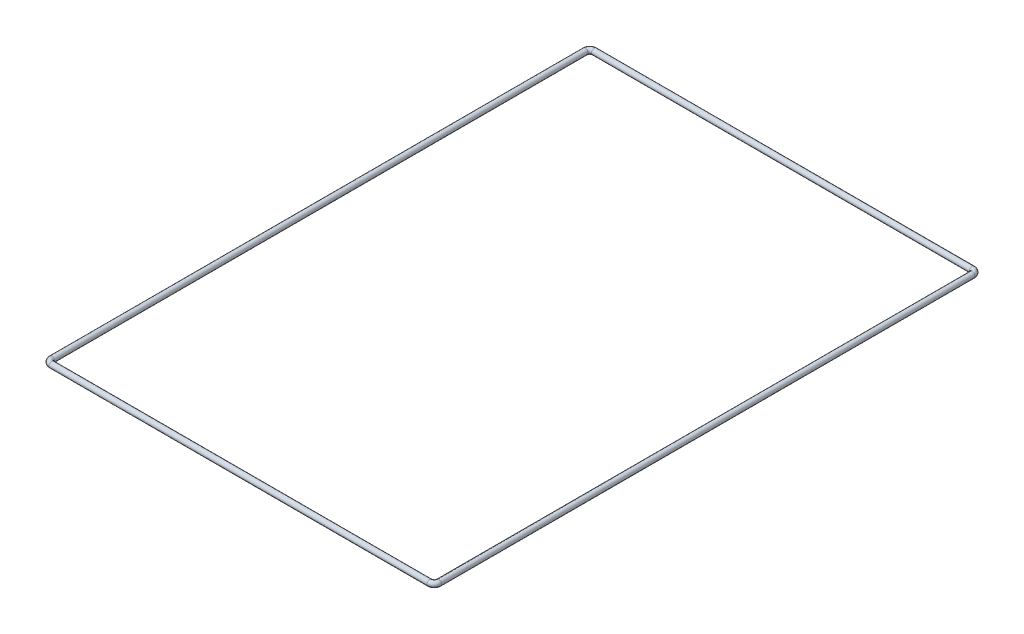
ISO-10303-21;
HEADER;
FILE_DESCRIPTION(('STEP AP214'),'2;1');
FILE_NAME('part.step','',(''),(''),'','','');
FILE_SCHEMA(('AUTOMOTIVE_DESIGN { 1 0 10303 214 1 1 1 1 }'));
ENDSEC;
DATA;
#1=APPLICATION_CONTEXT('core data for automotive mechanical design processes');
#2=APPLICATION_PROTOCOL_DEFINITION('international standard','automotive_design',2000,#1);
#3=PRODUCT_CONTEXT('',#1,'mechanical');
#4=PRODUCT('Part','Part','',(#3));
#5=PRODUCT_RELATED_PRODUCT_CATEGORY('part','',(#4));
#6=PRODUCT_DEFINITION_FORMATION('','',#4);
#7=PRODUCT_DEFINITION_CONTEXT('part definition',#1,'design');
#8=PRODUCT_DEFINITION('design','',#6,#7);
#9=PRODUCT_DEFINITION_SHAPE('','',#8);
#10=(LENGTH_UNIT() NAMED_UNIT(*) SI_UNIT(.MILLI.,.METRE.));
#11=(NAMED_UNIT(*) PLANE_ANGLE_UNIT() SI_UNIT($,.RADIAN.));
#12=(NAMED_UNIT(*) SI_UNIT($,.STERADIAN.) SOLID_ANGLE_UNIT());
#13=UNCERTAINTY_MEASURE_WITH_UNIT(LENGTH_MEASURE(1.E-05),#10,'distance_accuracy_value','');
#14=(GEOMETRIC_REPRESENTATION_CONTEXT(3) GLOBAL_UNCERTAINTY_ASSIGNED_CONTEXT((#13)) GLOBAL_UNIT_ASSIGNED_CONTEXT((#10,
#11,#12)) REPRESENTATION_CONTEXT('',''));
#15=CARTESIAN_POINT('',(0.,0.,0.));
#16=DIRECTION('',(0.,0.,1.));
#17=DIRECTION('',(1.,0.,0.));
#18=AXIS2_PLACEMENT_3D('',#15,#16,#17);
#19=CARTESIAN_POINT('',(6.35,0.,591.762225458784));
#20=DIRECTION('',(0.,-1.,0.));
#21=DIRECTION('',(0.,0.,-1.));
#22=AXIS2_PLACEMENT_3D('',#19,#20,#21);
#23=TOROIDAL_SURFACE('',#22,6.34999999999997,3.96875);
#24=CARTESIAN_POINT('',(6.34999999999997,0.,598.112225458784));
#25=DIRECTION('',(-1.,0.,0.));
#26=DIRECTION('',(0.,0.,1.));
#27=AXIS2_PLACEMENT_3D('',#24,#25,#26);
#28=CIRCLE('',#27,3.96875);
#29=CARTESIAN_POINT('',(6.34999999999995,0.,602.080975458784));
#30=VERTEX_POINT('',#29);
#31=EDGE_CURVE('E35',#30,#30,#28,.T.);
#32=CARTESIAN_POINT('',(0.,0.,591.762225458784));
#33=DIRECTION('',(0.,0.,-1.));
#34=DIRECTION('',(-1.,0.,0.));
#35=AXIS2_PLACEMENT_3D('',#32,#33,#34);
#36=CIRCLE('',#35,3.96875);
#37=CARTESIAN_POINT('',(-3.96874999999997,0.,591.762225458784));
#38=VERTEX_POINT('',#37);
#39=EDGE_CURVE('E48',#38,#38,#36,.T.);
#40=CARTESIAN_POINT('',(6.35,0.,591.762225458784));
#41=DIRECTION('',(0.,-1.,0.));
#42=DIRECTION('',(0.,0.,-1.));
#43=AXIS2_PLACEMENT_3D('',#40,#41,#42);
#44=CIRCLE('',#43,10.31875);
#45=EDGE_CURVE('',#30,#38,#44,.T.);
#46=ORIENTED_EDGE('',*,*,#31,.T.);
#47=ORIENTED_EDGE('',*,*,#39,.F.);
#48=ORIENTED_EDGE('',*,*,#45,.T.);
#49=ORIENTED_EDGE('',*,*,#45,.F.);
#50=EDGE_LOOP('',(#46,#48,#47,#49));
#51=FACE_BOUND('',#50,.T.);
#52=ADVANCED_FACE('F32',(#51),#23,.T.);
#53=CARTESIAN_POINT('',(538.3657,0.,598.112225458784));
#54=DIRECTION('',(-1.,0.,0.));
#55=DIRECTION('',(0.,0.,1.));
#56=AXIS2_PLACEMENT_3D('',#53,#54,#55);
#57=CYLINDRICAL_SURFACE('',#56,3.96875);
#58=ORIENTED_EDGE('',*,*,#31,.F.);
#59=EDGE_LOOP('',(#58));
#60=FACE_BOUND('',#59,.T.);
#61=CARTESIAN_POINT('',(538.3657,0.,598.112225458784));
#62=DIRECTION('',(-1.,0.,0.));
#63=DIRECTION('',(0.,0.,1.));
#64=AXIS2_PLACEMENT_3D('',#61,#62,#63);
#65=CIRCLE('',#64,3.96875);
#66=CARTESIAN_POINT('',(538.3657,0.,602.080975458784));
#67=VERTEX_POINT('',#66);
#68=EDGE_CURVE('E65',#67,#67,#65,.T.);
#69=ORIENTED_EDGE('',*,*,#68,.T.);
#70=EDGE_LOOP('',(#69));
#71=FACE_BOUND('',#70,.T.);
#72=ADVANCED_FACE('F159',(#60,#71),#57,.T.);
#73=CARTESIAN_POINT('',(538.3657,0.,591.762225458784));
#74=DIRECTION('',(0.,-1.,0.));
#75=DIRECTION('',(0.,0.,-1.));
#76=AXIS2_PLACEMENT_3D('',#73,#74,#75);
#77=TOROIDAL_SURFACE('',#76,6.34999999999997,3.96875);
#78=CARTESIAN_POINT('',(544.7157,0.,591.762225458784));
#79=DIRECTION('',(0.,0.,1.));
#80=DIRECTION('',(1.,0.,0.));
#81=AXIS2_PLACEMENT_3D('',#78,#79,#80);
#82=CIRCLE('',#81,3.96875);
#83=CARTESIAN_POINT('',(548.68445,0.,591.762225458784));
#84=VERTEX_POINT('',#83);
#85=EDGE_CURVE('E63',#84,#84,#82,.T.);
#86=CARTESIAN_POINT('',(538.3657,0.,591.762225458784));
#87=DIRECTION('',(0.,-1.,0.));
#88=DIRECTION('',(0.,0.,-1.));
#89=AXIS2_PLACEMENT_3D('',#86,#87,#88);
#90=CIRCLE('',#89,10.31875);
#91=EDGE_CURVE('',#84,#67,#90,.T.);
#92=ORIENTED_EDGE('',*,*,#85,.T.);
#93=ORIENTED_EDGE('',*,*,#68,.F.);
#94=ORIENTED_EDGE('',*,*,#91,.T.);
#95=ORIENTED_EDGE('',*,*,#91,.F.);
#96=EDGE_LOOP('',(#92,#94,#93,#95));
#97=FACE_BOUND('',#96,.T.);
#98=ADVANCED_FACE('F156',(#97),#77,.T.);
#99=CARTESIAN_POINT('',(544.7157,0.,-159.226874541216));
#100=DIRECTION('',(0.,0.,1.));
#101=DIRECTION('',(1.,0.,0.));
#102=AXIS2_PLACEMENT_3D('',#99,#100,#101);
#103=CYLINDRICAL_SURFACE('',#102,3.96875);
#104=ORIENTED_EDGE('',*,*,#85,.F.);
#105=EDGE_LOOP('',(#104));
#106=FACE_BOUND('',#105,.T.);
#107=CARTESIAN_POINT('',(544.7157,0.,-159.226874541216));
#108=DIRECTION('',(0.,0.,1.));
#109=DIRECTION('',(1.,0.,0.));
#110=AXIS2_PLACEMENT_3D('',#107,#108,#109);
#111=CIRCLE('',#110,3.96875);
#112=CARTESIAN_POINT('',(548.68445,0.,-159.226874541216));
#113=VERTEX_POINT('',#112);
#114=EDGE_CURVE('E60',#113,#113,#111,.T.);
#115=ORIENTED_EDGE('',*,*,#114,.T.);
#116=EDGE_LOOP('',(#115));
#117=FACE_BOUND('',#116,.T.);
#118=ADVANCED_FACE('F152',(#106,#117),#103,.T.);
#119=CARTESIAN_POINT('',(538.3657,0.,-159.226874541216));
#120=DIRECTION('',(0.,-1.,0.));
#121=DIRECTION('',(0.,0.,-1.));
#122=AXIS2_PLACEMENT_3D('',#119,#120,#121);
#123=TOROIDAL_SURFACE('',#122,6.34999999999999,3.96875);
#124=CARTESIAN_POINT('',(538.3657,0.,-165.576874541216));
#125=DIRECTION('',(1.,0.,0.));
#126=DIRECTION('',(0.,0.,-1.));
#127=AXIS2_PLACEMENT_3D('',#124,#125,#126);
#128=CIRCLE('',#127,3.96875);
#129=CARTESIAN_POINT('',(538.3657,0.,-169.545624541216));
#130=VERTEX_POINT('',#129);
#131=EDGE_CURVE('E57',#130,#130,#128,.T.);
#132=CARTESIAN_POINT('',(538.3657,0.,-159.226874541216));
#133=DIRECTION('',(0.,-1.,0.));
#134=DIRECTION('',(0.,0.,-1.));
#135=AXIS2_PLACEMENT_3D('',#132,#133,#134);
#136=CIRCLE('',#135,10.31875);
#137=EDGE_CURVE('',#130,#113,#136,.T.);
#138=ORIENTED_EDGE('',*,*,#131,.T.);
#139=ORIENTED_EDGE('',*,*,#114,.F.);
#140=ORIENTED_EDGE('',*,*,#137,.T.);
#141=ORIENTED_EDGE('',*,*,#137,.F.);
#142=EDGE_LOOP('',(#138,#140,#139,#141));
#143=FACE_BOUND('',#142,.T.);
#144=ADVANCED_FACE('F148',(#143),#123,.T.);
#145=CARTESIAN_POINT('',(6.34999999999997,0.,-165.576874541216));
#146=DIRECTION('',(1.,0.,0.));
#147=DIRECTION('',(0.,0.,-1.));
#148=AXIS2_PLACEMENT_3D('',#145,#146,#147);
#149=CYLINDRICAL_SURFACE('',#148,3.96875);
#150=ORIENTED_EDGE('',*,*,#131,.F.);
#151=EDGE_LOOP('',(#150));
#152=FACE_BOUND('',#151,.T.);
#153=CARTESIAN_POINT('',(6.34999999999997,0.,-165.576874541216));
#154=DIRECTION('',(1.,0.,0.));
#155=DIRECTION('',(0.,0.,-1.));
#156=AXIS2_PLACEMENT_3D('',#153,#154,#155);
#157=CIRCLE('',#156,3.96875);
#158=CARTESIAN_POINT('',(6.34999999999995,0.,-169.545624541216));
#159=VERTEX_POINT('',#158);
#160=EDGE_CURVE('E54',#159,#159,#157,.T.);
#161=ORIENTED_EDGE('',*,*,#160,.T.);
#162=EDGE_LOOP('',(#161));
#163=FACE_BOUND('',#162,.T.);
#164=ADVANCED_FACE('F144',(#152,#163),#149,.T.);
#165=CARTESIAN_POINT('',(6.35,0.,-159.226874541216));
#166=DIRECTION('',(0.,-1.,0.));
#167=DIRECTION('',(0.,0.,-1.));
#168=AXIS2_PLACEMENT_3D('',#165,#166,#167);
#169=TOROIDAL_SURFACE('',#168,6.35,3.96875);
#170=CARTESIAN_POINT('',(0.,0.,-159.226874541216));
#171=DIRECTION('',(0.,0.,-1.));
#172=DIRECTION('',(-1.,0.,0.));
#173=AXIS2_PLACEMENT_3D('',#170,#171,#172);
#174=CIRCLE('',#173,3.96875);
#175=CARTESIAN_POINT('',(-3.96875,0.,-159.226874541216));
#176=VERTEX_POINT('',#175);
#177=EDGE_CURVE('E51',#176,#176,#174,.T.);
#178=CARTESIAN_POINT('',(6.35,0.,-159.226874541216));
#179=DIRECTION('',(0.,-1.,0.));
#180=DIRECTION('',(0.,0.,-1.));
#181=AXIS2_PLACEMENT_3D('',#178,#179,#180);
#182=CIRCLE('',#181,10.31875);
#183=EDGE_CURVE('',#176,#159,#182,.T.);
#184=ORIENTED_EDGE('',*,*,#177,.T.);
#185=ORIENTED_EDGE('',*,*,#160,.F.);
#186=ORIENTED_EDGE('',*,*,#183,.T.);
#187=ORIENTED_EDGE('',*,*,#183,.F.);
#188=EDGE_LOOP('',(#184,#186,#185,#187));
#189=FACE_BOUND('',#188,.T.);
#190=ADVANCED_FACE('F140',(#189),#169,.T.);
#191=CARTESIAN_POINT('',(0.,0.,591.762225458784));
#192=DIRECTION('',(0.,0.,-1.));
#193=DIRECTION('',(-1.,0.,0.));
#194=AXIS2_PLACEMENT_3D('',#191,#192,#193);
#195=CYLINDRICAL_SURFACE('',#194,3.96875);
#196=ORIENTED_EDGE('',*,*,#177,.F.);
#197=EDGE_LOOP('',(#196));
#198=FACE_BOUND('',#197,.T.);
#199=ORIENTED_EDGE('',*,*,#39,.T.);
#200=EDGE_LOOP('',(#199));
#201=FACE_BOUND('',#200,.T.);
#202=ADVANCED_FACE('F138',(#198,#201),#195,.T.);
#203=CLOSED_SHELL('',(#52,#72,#98,#118,#144,#164,#190,#202));
#204=CARTESIAN_POINT('',(6.35,0.,591.762225458784));
#205=DIRECTION('',(0.,-1.,0.));
#206=DIRECTION('',(0.,0.,-1.));
#207=AXIS2_PLACEMENT_3D('',#204,#205,#206);
#208=TOROIDAL_SURFACE('',#207,6.34999999999997,2.38125);
#209=CARTESIAN_POINT('',(6.34999999999997,0.,598.112225458784));
#210=DIRECTION('',(-1.,0.,0.));
#211=DIRECTION('',(0.,0.,1.));
#212=AXIS2_PLACEMENT_3D('',#209,#210,#211);
#213=CIRCLE('',#212,2.38125);
#214=CARTESIAN_POINT('',(6.34999999999995,0.,600.493475458784));
#215=VERTEX_POINT('',#214);
#216=EDGE_CURVE('E10',#215,#215,#213,.F.);
#217=CARTESIAN_POINT('',(0.,0.,591.762225458784));
#218=DIRECTION('',(0.,0.,-1.));
#219=DIRECTION('',(-1.,0.,0.));
#220=AXIS2_PLACEMENT_3D('',#217,#218,#219);
#221=CIRCLE('',#220,2.38125);
#222=CARTESIAN_POINT('',(-2.38124999999997,0.,591.762225458784));
#223=VERTEX_POINT('',#222);
#224=EDGE_CURVE('E70',#223,#223,#221,.F.);
#225=CARTESIAN_POINT('',(6.35,0.,591.762225458784));
#226=DIRECTION('',(0.,-1.,0.));
#227=DIRECTION('',(0.,0.,-1.));
#228=AXIS2_PLACEMENT_3D('',#225,#226,#227);
#229=CIRCLE('',#228,8.73124999999997);
#230=EDGE_CURVE('',#215,#223,#229,.T.);
#231=ORIENTED_EDGE('',*,*,#216,.T.);
#232=ORIENTED_EDGE('',*,*,#224,.F.);
#233=ORIENTED_EDGE('',*,*,#230,.T.);
#234=ORIENTED_EDGE('',*,*,#230,.F.);
#235=EDGE_LOOP('',(#231,#233,#232,#234));
#236=FACE_BOUND('',#235,.T.);
#237=ADVANCED_FACE('F124',(#236),#208,.F.);
#238=CARTESIAN_POINT('',(538.3657,0.,598.112225458784));
#239=DIRECTION('',(-1.,0.,0.));
#240=DIRECTION('',(0.,0.,1.));
#241=AXIS2_PLACEMENT_3D('',#238,#239,#240);
#242=CYLINDRICAL_SURFACE('',#241,2.38125);
#243=ORIENTED_EDGE('',*,*,#216,.F.);
#244=EDGE_LOOP('',(#243));
#245=FACE_BOUND('',#244,.T.);
#246=CARTESIAN_POINT('',(538.3657,0.,598.112225458784));
#247=DIRECTION('',(-1.,0.,0.));
#248=DIRECTION('',(0.,0.,1.));
#249=AXIS2_PLACEMENT_3D('',#246,#247,#248);
#250=CIRCLE('',#249,2.38125);
#251=CARTESIAN_POINT('',(538.3657,0.,600.493475458784));
#252=VERTEX_POINT('',#251);
#253=EDGE_CURVE('E39',#252,#252,#250,.F.);
#254=ORIENTED_EDGE('',*,*,#253,.T.);
#255=EDGE_LOOP('',(#254));
#256=FACE_BOUND('',#255,.T.);
#257=ADVANCED_FACE('F127',(#245,#256),#242,.F.);
#258=CARTESIAN_POINT('',(538.3657,0.,591.762225458784));
#259=DIRECTION('',(0.,-1.,0.));
#260=DIRECTION('',(0.,0.,-1.));
#261=AXIS2_PLACEMENT_3D('',#258,#259,#260);
#262=TOROIDAL_SURFACE('',#261,6.34999999999997,2.38125);
#263=CARTESIAN_POINT('',(544.7157,0.,591.762225458784));
#264=DIRECTION('',(0.,0.,1.));
#265=DIRECTION('',(1.,0.,0.));
#266=AXIS2_PLACEMENT_3D('',#263,#264,#265);
#267=CIRCLE('',#266,2.38125);
#268=CARTESIAN_POINT('',(547.09695,0.,591.762225458784));
#269=VERTEX_POINT('',#268);
#270=EDGE_CURVE('E44',#269,#269,#267,.F.);
#271=CARTESIAN_POINT('',(538.3657,0.,591.762225458784));
#272=DIRECTION('',(0.,-1.,0.));
#273=DIRECTION('',(0.,0.,-1.));
#274=AXIS2_PLACEMENT_3D('',#271,#272,#273);
#275=CIRCLE('',#274,8.73124999999997);
#276=EDGE_CURVE('',#269,#252,#275,.T.);
#277=ORIENTED_EDGE('',*,*,#270,.T.);
#278=ORIENTED_EDGE('',*,*,#253,.F.);
#279=ORIENTED_EDGE('',*,*,#276,.T.);
#280=ORIENTED_EDGE('',*,*,#276,.F.);
#281=EDGE_LOOP('',(#277,#279,#278,#280));
#282=FACE_BOUND('',#281,.T.);
#283=ADVANCED_FACE('F92',(#282),#262,.F.);
#284=CARTESIAN_POINT('',(544.7157,0.,-159.226874541216));
#285=DIRECTION('',(0.,0.,1.));
#286=DIRECTION('',(1.,0.,0.));
#287=AXIS2_PLACEMENT_3D('',#284,#285,#286);
#288=CYLINDRICAL_SURFACE('',#287,2.38125);
#289=ORIENTED_EDGE('',*,*,#270,.F.);
#290=EDGE_LOOP('',(#289));
#291=FACE_BOUND('',#290,.T.);
#292=CARTESIAN_POINT('',(544.7157,0.,-159.226874541216));
#293=DIRECTION('',(0.,0.,1.));
#294=DIRECTION('',(1.,0.,0.));
#295=AXIS2_PLACEMENT_3D('',#292,#293,#294);
#296=CIRCLE('',#295,2.38125);
#297=CARTESIAN_POINT('',(547.09695,0.,-159.226874541216));
#298=VERTEX_POINT('',#297);
#299=EDGE_CURVE('E87',#298,#298,#296,.F.);
#300=ORIENTED_EDGE('',*,*,#299,.T.);
#301=EDGE_LOOP('',(#300));
#302=FACE_BOUND('',#301,.T.);
#303=ADVANCED_FACE('F94',(#291,#302),#288,.F.);
#304=CARTESIAN_POINT('',(538.3657,0.,-159.226874541216));
#305=DIRECTION('',(0.,-1.,0.));
#306=DIRECTION('',(0.,0.,-1.));
#307=AXIS2_PLACEMENT_3D('',#304,#305,#306);
#308=TOROIDAL_SURFACE('',#307,6.34999999999999,2.38125);
#309=CARTESIAN_POINT('',(538.3657,0.,-165.576874541216));
#310=DIRECTION('',(1.,0.,0.));
#311=DIRECTION('',(0.,0.,-1.));
#312=AXIS2_PLACEMENT_3D('',#309,#310,#311);
#313=CIRCLE('',#312,2.38125);
#314=CARTESIAN_POINT('',(538.3657,0.,-167.958124541216));
#315=VERTEX_POINT('',#314);
#316=EDGE_CURVE('E84',#315,#315,#313,.F.);
#317=CARTESIAN_POINT('',(538.3657,0.,-159.226874541216));
#318=DIRECTION('',(0.,-1.,0.));
#319=DIRECTION('',(0.,0.,-1.));
#320=AXIS2_PLACEMENT_3D('',#317,#318,#319);
#321=CIRCLE('',#320,8.73124999999999);
#322=EDGE_CURVE('',#315,#298,#321,.T.);
#323=ORIENTED_EDGE('',*,*,#316,.T.);
#324=ORIENTED_EDGE('',*,*,#299,.F.);
#325=ORIENTED_EDGE('',*,*,#322,.T.);
#326=ORIENTED_EDGE('',*,*,#322,.F.);
#327=EDGE_LOOP('',(#323,#325,#324,#326));
#328=FACE_BOUND('',#327,.T.);
#329=ADVANCED_FACE('F97',(#328),#308,.F.);
#330=CARTESIAN_POINT('',(6.34999999999997,0.,-165.576874541216));
#331=DIRECTION('',(1.,0.,0.));
#332=DIRECTION('',(0.,0.,-1.));
#333=AXIS2_PLACEMENT_3D('',#330,#331,#332);
#334=CYLINDRICAL_SURFACE('',#333,2.38125);
#335=ORIENTED_EDGE('',*,*,#316,.F.);
#336=EDGE_LOOP('',(#335));
#337=FACE_BOUND('',#336,.T.);
#338=CARTESIAN_POINT('',(6.34999999999997,0.,-165.576874541216));
#339=DIRECTION('',(1.,0.,0.));
#340=DIRECTION('',(0.,0.,-1.));
#341=AXIS2_PLACEMENT_3D('',#338,#339,#340);
#342=CIRCLE('',#341,2.38125);
#343=CARTESIAN_POINT('',(6.34999999999995,0.,-167.958124541216));
#344=VERTEX_POINT('',#343);
#345=EDGE_CURVE('E79',#344,#344,#342,.F.);
#346=ORIENTED_EDGE('',*,*,#345,.T.);
#347=EDGE_LOOP('',(#346));
#348=FACE_BOUND('',#347,.T.);
#349=ADVANCED_FACE('F104',(#337,#348),#334,.F.);
#350=CARTESIAN_POINT('',(6.35,0.,-159.226874541216));
#351=DIRECTION('',(0.,-1.,0.));
#352=DIRECTION('',(0.,0.,-1.));
#353=AXIS2_PLACEMENT_3D('',#350,#351,#352);
#354=TOROIDAL_SURFACE('',#353,6.35,2.38125);
#355=CARTESIAN_POINT('',(0.,0.,-159.226874541216));
#356=DIRECTION('',(0.,0.,-1.));
#357=DIRECTION('',(-1.,0.,0.));
#358=AXIS2_PLACEMENT_3D('',#355,#356,#357);
#359=CIRCLE('',#358,2.38125);
#360=CARTESIAN_POINT('',(-2.38125,0.,-159.226874541216));
#361=VERTEX_POINT('',#360);
#362=EDGE_CURVE('E74',#361,#361,#359,.F.);
#363=CARTESIAN_POINT('',(6.35,0.,-159.226874541216));
#364=DIRECTION('',(0.,-1.,0.));
#365=DIRECTION('',(0.,0.,-1.));
#366=AXIS2_PLACEMENT_3D('',#363,#364,#365);
#367=CIRCLE('',#366,8.73125);
#368=EDGE_CURVE('',#361,#344,#367,.T.);
#369=ORIENTED_EDGE('',*,*,#362,.T.);
#370=ORIENTED_EDGE('',*,*,#345,.F.);
#371=ORIENTED_EDGE('',*,*,#368,.T.);
#372=ORIENTED_EDGE('',*,*,#368,.F.);
#373=EDGE_LOOP('',(#369,#371,#370,#372));
#374=FACE_BOUND('',#373,.T.);
#375=ADVANCED_FACE('F110',(#374),#354,.F.);
#376=CARTESIAN_POINT('',(0.,0.,591.762225458784));
#377=DIRECTION('',(0.,0.,-1.));
#378=DIRECTION('',(-1.,0.,0.));
#379=AXIS2_PLACEMENT_3D('',#376,#377,#378);
#380=CYLINDRICAL_SURFACE('',#379,2.38125);
#381=ORIENTED_EDGE('',*,*,#362,.F.);
#382=EDGE_LOOP('',(#381));
#383=FACE_BOUND('',#382,.T.);
#384=ORIENTED_EDGE('',*,*,#224,.T.);
#385=EDGE_LOOP('',(#384));
#386=FACE_BOUND('',#385,.T.);
#387=ADVANCED_FACE('F116',(#383,#386),#380,.F.);
#388=CLOSED_SHELL('',(#237,#257,#283,#303,#329,#349,#375,#387));
#389=ORIENTED_CLOSED_SHELL('',*,#388,.T.);
#390=BREP_WITH_VOIDS('B2',#203,(#389));
#391=ADVANCED_BREP_SHAPE_REPRESENTATION('',(#18,#390),#14);
#392=SHAPE_DEFINITION_REPRESENTATION(#9,#391);
ENDSEC;
END-ISO-10303-21;
